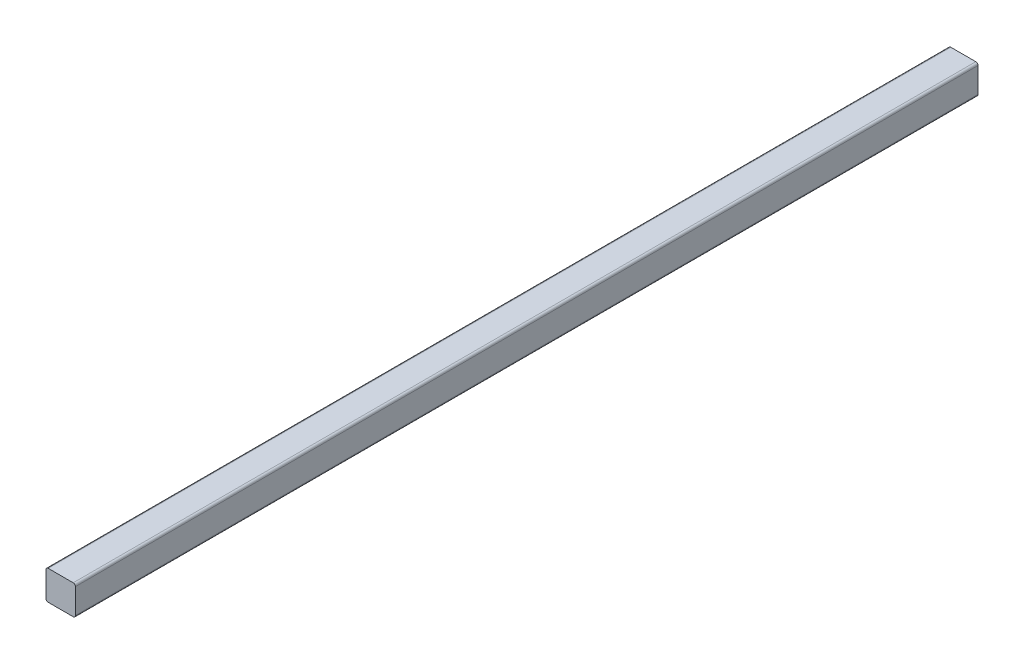
ISO-10303-21;
HEADER;
FILE_DESCRIPTION(('STEP AP214'),'2;1');
FILE_NAME('part.step','',(''),(''),'','','');
FILE_SCHEMA(('AUTOMOTIVE_DESIGN { 1 0 10303 214 1 1 1 1 }'));
ENDSEC;
DATA;
#1=APPLICATION_CONTEXT('core data for automotive mechanical design processes');
#2=APPLICATION_PROTOCOL_DEFINITION('international standard','automotive_design',2000,#1);
#3=PRODUCT_CONTEXT('',#1,'mechanical');
#4=PRODUCT('Part','Part','',(#3));
#5=PRODUCT_RELATED_PRODUCT_CATEGORY('part','',(#4));
#6=PRODUCT_DEFINITION_FORMATION('','',#4);
#7=PRODUCT_DEFINITION_CONTEXT('part definition',#1,'design');
#8=PRODUCT_DEFINITION('design','',#6,#7);
#9=PRODUCT_DEFINITION_SHAPE('','',#8);
#10=(LENGTH_UNIT() NAMED_UNIT(*) SI_UNIT(.MILLI.,.METRE.));
#11=(NAMED_UNIT(*) PLANE_ANGLE_UNIT() SI_UNIT($,.RADIAN.));
#12=(NAMED_UNIT(*) SI_UNIT($,.STERADIAN.) SOLID_ANGLE_UNIT());
#13=UNCERTAINTY_MEASURE_WITH_UNIT(LENGTH_MEASURE(1.E-05),#10,'distance_accuracy_value','');
#14=(GEOMETRIC_REPRESENTATION_CONTEXT(3) GLOBAL_UNCERTAINTY_ASSIGNED_CONTEXT((#13)) GLOBAL_UNIT_ASSIGNED_CONTEXT((#10,
#11,#12)) REPRESENTATION_CONTEXT('',''));
#15=CARTESIAN_POINT('',(0.,0.,0.));
#16=DIRECTION('',(0.,0.,1.));
#17=DIRECTION('',(1.,0.,0.));
#18=AXIS2_PLACEMENT_3D('',#15,#16,#17);
#19=CARTESIAN_POINT('',(12.75,12.75,920.));
#20=DIRECTION('',(0.,0.,-1.));
#21=DIRECTION('',(-1.,0.,0.));
#22=AXIS2_PLACEMENT_3D('',#19,#20,#21);
#23=CYLINDRICAL_SURFACE('',#22,2.25);
#24=CARTESIAN_POINT('',(12.75,12.75,0.));
#25=DIRECTION('',(0.,0.,1.));
#26=DIRECTION('',(-1.,0.,0.));
#27=AXIS2_PLACEMENT_3D('',#24,#25,#26);
#28=CIRCLE('',#27,2.25);
#29=CARTESIAN_POINT('',(15.,12.75,0.));
#30=VERTEX_POINT('',#29);
#31=CARTESIAN_POINT('',(12.75,15.,0.));
#32=VERTEX_POINT('',#31);
#33=EDGE_CURVE('E101',#30,#32,#28,.T.);
#34=ORIENTED_EDGE('',*,*,#33,.T.);
#35=DIRECTION('',(0.,0.,-1.));
#36=VECTOR('',#35,1.);
#37=CARTESIAN_POINT('',(12.75,15.,920.));
#38=LINE('',#37,#36);
#39=CARTESIAN_POINT('',(12.75,15.,920.));
#40=VERTEX_POINT('',#39);
#41=EDGE_CURVE('E11',#40,#32,#38,.T.);
#42=ORIENTED_EDGE('',*,*,#41,.F.);
#43=CARTESIAN_POINT('',(12.75,12.75,920.));
#44=DIRECTION('',(0.,0.,1.));
#45=DIRECTION('',(-1.,0.,0.));
#46=AXIS2_PLACEMENT_3D('',#43,#44,#45);
#47=CIRCLE('',#46,2.25);
#48=CARTESIAN_POINT('',(15.,12.75,920.));
#49=VERTEX_POINT('',#48);
#50=EDGE_CURVE('E128',#49,#40,#47,.T.);
#51=ORIENTED_EDGE('',*,*,#50,.F.);
#52=DIRECTION('',(0.,0.,-1.));
#53=VECTOR('',#52,1.);
#54=CARTESIAN_POINT('',(15.,12.75,920.));
#55=LINE('',#54,#53);
#56=EDGE_CURVE('E114',#49,#30,#55,.T.);
#57=ORIENTED_EDGE('',*,*,#56,.T.);
#58=EDGE_LOOP('',(#34,#42,#51,#57));
#59=FACE_BOUND('',#58,.T.);
#60=ADVANCED_FACE('F33',(#59),#23,.T.);
#61=CARTESIAN_POINT('',(-12.75,15.,920.));
#62=DIRECTION('',(0.,-1.,0.));
#63=DIRECTION('',(0.,0.,-1.));
#64=AXIS2_PLACEMENT_3D('',#61,#62,#63);
#65=PLANE('',#64);
#66=DIRECTION('',(-1.,0.,0.));
#67=VECTOR('',#66,1.);
#68=CARTESIAN_POINT('',(-12.75,15.,0.));
#69=LINE('',#68,#67);
#70=CARTESIAN_POINT('',(-12.75,15.,0.));
#71=VERTEX_POINT('',#70);
#72=EDGE_CURVE('E97',#32,#71,#69,.T.);
#73=ORIENTED_EDGE('',*,*,#72,.T.);
#74=DIRECTION('',(0.,0.,-1.));
#75=VECTOR('',#74,1.);
#76=CARTESIAN_POINT('',(-12.75,15.,920.));
#77=LINE('',#76,#75);
#78=CARTESIAN_POINT('',(-12.75,15.,920.));
#79=VERTEX_POINT('',#78);
#80=EDGE_CURVE('E40',#79,#71,#77,.T.);
#81=ORIENTED_EDGE('',*,*,#80,.F.);
#82=DIRECTION('',(-1.,0.,0.));
#83=VECTOR('',#82,1.);
#84=CARTESIAN_POINT('',(-12.75,15.,920.));
#85=LINE('',#84,#83);
#86=EDGE_CURVE('E110',#40,#79,#85,.T.);
#87=ORIENTED_EDGE('',*,*,#86,.F.);
#88=ORIENTED_EDGE('',*,*,#41,.T.);
#89=EDGE_LOOP('',(#73,#81,#87,#88));
#90=FACE_BOUND('',#89,.T.);
#91=ADVANCED_FACE('F109',(#90),#65,.F.);
#92=CARTESIAN_POINT('',(-12.75,12.75,920.));
#93=DIRECTION('',(0.,0.,-1.));
#94=DIRECTION('',(-1.,0.,0.));
#95=AXIS2_PLACEMENT_3D('',#92,#93,#94);
#96=CYLINDRICAL_SURFACE('',#95,2.25);
#97=CARTESIAN_POINT('',(-12.75,12.75,0.));
#98=DIRECTION('',(0.,0.,1.));
#99=DIRECTION('',(1.,0.,0.));
#100=AXIS2_PLACEMENT_3D('',#97,#98,#99);
#101=CIRCLE('',#100,2.25);
#102=CARTESIAN_POINT('',(-15.,12.75,0.));
#103=VERTEX_POINT('',#102);
#104=EDGE_CURVE('E103',#71,#103,#101,.T.);
#105=ORIENTED_EDGE('',*,*,#104,.T.);
#106=DIRECTION('',(0.,0.,-1.));
#107=VECTOR('',#106,1.);
#108=CARTESIAN_POINT('',(-15.,12.75,920.));
#109=LINE('',#108,#107);
#110=CARTESIAN_POINT('',(-15.,12.75,920.));
#111=VERTEX_POINT('',#110);
#112=EDGE_CURVE('E154',#111,#103,#109,.T.);
#113=ORIENTED_EDGE('',*,*,#112,.F.);
#114=CARTESIAN_POINT('',(-12.75,12.75,920.));
#115=DIRECTION('',(0.,0.,1.));
#116=DIRECTION('',(1.,0.,0.));
#117=AXIS2_PLACEMENT_3D('',#114,#115,#116);
#118=CIRCLE('',#117,2.25);
#119=EDGE_CURVE('E131',#79,#111,#118,.T.);
#120=ORIENTED_EDGE('',*,*,#119,.F.);
#121=ORIENTED_EDGE('',*,*,#80,.T.);
#122=EDGE_LOOP('',(#105,#113,#120,#121));
#123=FACE_BOUND('',#122,.T.);
#124=ADVANCED_FACE('F158',(#123),#96,.T.);
#125=CARTESIAN_POINT('',(-15.,12.75,920.));
#126=DIRECTION('',(1.,0.,0.));
#127=DIRECTION('',(0.,0.,-1.));
#128=AXIS2_PLACEMENT_3D('',#125,#126,#127);
#129=PLANE('',#128);
#130=DIRECTION('',(0.,-1.,0.));
#131=VECTOR('',#130,1.);
#132=CARTESIAN_POINT('',(-15.,12.75,0.));
#133=LINE('',#132,#131);
#134=CARTESIAN_POINT('',(-15.,-12.75,0.));
#135=VERTEX_POINT('',#134);
#136=EDGE_CURVE('E118',#103,#135,#133,.T.);
#137=ORIENTED_EDGE('',*,*,#136,.T.);
#138=DIRECTION('',(0.,0.,-1.));
#139=VECTOR('',#138,1.);
#140=CARTESIAN_POINT('',(-15.,-12.75,920.));
#141=LINE('',#140,#139);
#142=CARTESIAN_POINT('',(-15.,-12.75,920.));
#143=VERTEX_POINT('',#142);
#144=EDGE_CURVE('E151',#143,#135,#141,.T.);
#145=ORIENTED_EDGE('',*,*,#144,.F.);
#146=DIRECTION('',(0.,-1.,0.));
#147=VECTOR('',#146,1.);
#148=CARTESIAN_POINT('',(-15.,12.75,920.));
#149=LINE('',#148,#147);
#150=EDGE_CURVE('E133',#111,#143,#149,.T.);
#151=ORIENTED_EDGE('',*,*,#150,.F.);
#152=ORIENTED_EDGE('',*,*,#112,.T.);
#153=EDGE_LOOP('',(#137,#145,#151,#152));
#154=FACE_BOUND('',#153,.T.);
#155=ADVANCED_FACE('F166',(#154),#129,.F.);
#156=CARTESIAN_POINT('',(-12.75,-12.75,920.));
#157=DIRECTION('',(0.,0.,-1.));
#158=DIRECTION('',(-1.,0.,0.));
#159=AXIS2_PLACEMENT_3D('',#156,#157,#158);
#160=CYLINDRICAL_SURFACE('',#159,2.25);
#161=CARTESIAN_POINT('',(-12.75,-12.75,0.));
#162=DIRECTION('',(0.,0.,1.));
#163=DIRECTION('',(-1.,0.,0.));
#164=AXIS2_PLACEMENT_3D('',#161,#162,#163);
#165=CIRCLE('',#164,2.25);
#166=CARTESIAN_POINT('',(-12.75,-15.,0.));
#167=VERTEX_POINT('',#166);
#168=EDGE_CURVE('E120',#135,#167,#165,.T.);
#169=ORIENTED_EDGE('',*,*,#168,.T.);
#170=DIRECTION('',(0.,0.,-1.));
#171=VECTOR('',#170,1.);
#172=CARTESIAN_POINT('',(-12.75,-15.,920.));
#173=LINE('',#172,#171);
#174=CARTESIAN_POINT('',(-12.75,-15.,920.));
#175=VERTEX_POINT('',#174);
#176=EDGE_CURVE('E148',#175,#167,#173,.T.);
#177=ORIENTED_EDGE('',*,*,#176,.F.);
#178=CARTESIAN_POINT('',(-12.75,-12.75,920.));
#179=DIRECTION('',(0.,0.,1.));
#180=DIRECTION('',(-1.,0.,0.));
#181=AXIS2_PLACEMENT_3D('',#178,#179,#180);
#182=CIRCLE('',#181,2.25);
#183=EDGE_CURVE('E135',#143,#175,#182,.T.);
#184=ORIENTED_EDGE('',*,*,#183,.F.);
#185=ORIENTED_EDGE('',*,*,#144,.T.);
#186=EDGE_LOOP('',(#169,#177,#184,#185));
#187=FACE_BOUND('',#186,.T.);
#188=ADVANCED_FACE('F169',(#187),#160,.T.);
#189=CARTESIAN_POINT('',(-12.75,-15.,920.));
#190=DIRECTION('',(0.,1.,0.));
#191=DIRECTION('',(0.,0.,1.));
#192=AXIS2_PLACEMENT_3D('',#189,#190,#191);
#193=PLANE('',#192);
#194=DIRECTION('',(1.,0.,0.));
#195=VECTOR('',#194,1.);
#196=CARTESIAN_POINT('',(-12.75,-15.,0.));
#197=LINE('',#196,#195);
#198=CARTESIAN_POINT('',(12.75,-15.,0.));
#199=VERTEX_POINT('',#198);
#200=EDGE_CURVE('E122',#167,#199,#197,.T.);
#201=ORIENTED_EDGE('',*,*,#200,.T.);
#202=DIRECTION('',(0.,0.,-1.));
#203=VECTOR('',#202,1.);
#204=CARTESIAN_POINT('',(12.75,-15.,920.));
#205=LINE('',#204,#203);
#206=CARTESIAN_POINT('',(12.75,-15.,920.));
#207=VERTEX_POINT('',#206);
#208=EDGE_CURVE('E145',#207,#199,#205,.T.);
#209=ORIENTED_EDGE('',*,*,#208,.F.);
#210=DIRECTION('',(1.,0.,0.));
#211=VECTOR('',#210,1.);
#212=CARTESIAN_POINT('',(-12.75,-15.,920.));
#213=LINE('',#212,#211);
#214=EDGE_CURVE('E137',#175,#207,#213,.T.);
#215=ORIENTED_EDGE('',*,*,#214,.F.);
#216=ORIENTED_EDGE('',*,*,#176,.T.);
#217=EDGE_LOOP('',(#201,#209,#215,#216));
#218=FACE_BOUND('',#217,.T.);
#219=ADVANCED_FACE('F174',(#218),#193,.F.);
#220=CARTESIAN_POINT('',(12.75,-12.75,920.));
#221=DIRECTION('',(0.,0.,-1.));
#222=DIRECTION('',(-1.,0.,0.));
#223=AXIS2_PLACEMENT_3D('',#220,#221,#222);
#224=CYLINDRICAL_SURFACE('',#223,2.25);
#225=CARTESIAN_POINT('',(12.75,-12.75,0.));
#226=DIRECTION('',(0.,0.,1.));
#227=DIRECTION('',(1.,0.,0.));
#228=AXIS2_PLACEMENT_3D('',#225,#226,#227);
#229=CIRCLE('',#228,2.25);
#230=CARTESIAN_POINT('',(15.,-12.75,0.));
#231=VERTEX_POINT('',#230);
#232=EDGE_CURVE('E124',#199,#231,#229,.T.);
#233=ORIENTED_EDGE('',*,*,#232,.T.);
#234=DIRECTION('',(0.,0.,-1.));
#235=VECTOR('',#234,1.);
#236=CARTESIAN_POINT('',(15.,-12.75,920.));
#237=LINE('',#236,#235);
#238=CARTESIAN_POINT('',(15.,-12.75,920.));
#239=VERTEX_POINT('',#238);
#240=EDGE_CURVE('E142',#239,#231,#237,.T.);
#241=ORIENTED_EDGE('',*,*,#240,.F.);
#242=CARTESIAN_POINT('',(12.75,-12.75,920.));
#243=DIRECTION('',(0.,0.,1.));
#244=DIRECTION('',(1.,0.,0.));
#245=AXIS2_PLACEMENT_3D('',#242,#243,#244);
#246=CIRCLE('',#245,2.25);
#247=EDGE_CURVE('E52',#207,#239,#246,.T.);
#248=ORIENTED_EDGE('',*,*,#247,.F.);
#249=ORIENTED_EDGE('',*,*,#208,.T.);
#250=EDGE_LOOP('',(#233,#241,#248,#249));
#251=FACE_BOUND('',#250,.T.);
#252=ADVANCED_FACE('F177',(#251),#224,.T.);
#253=CARTESIAN_POINT('',(15.,12.75,920.));
#254=DIRECTION('',(-1.,0.,0.));
#255=DIRECTION('',(0.,0.,1.));
#256=AXIS2_PLACEMENT_3D('',#253,#254,#255);
#257=PLANE('',#256);
#258=DIRECTION('',(0.,1.,0.));
#259=VECTOR('',#258,1.);
#260=CARTESIAN_POINT('',(15.,12.75,0.));
#261=LINE('',#260,#259);
#262=EDGE_CURVE('E126',#231,#30,#261,.T.);
#263=ORIENTED_EDGE('',*,*,#262,.T.);
#264=ORIENTED_EDGE('',*,*,#56,.F.);
#265=DIRECTION('',(0.,1.,0.));
#266=VECTOR('',#265,1.);
#267=CARTESIAN_POINT('',(15.,12.75,920.));
#268=LINE('',#267,#266);
#269=EDGE_CURVE('E47',#239,#49,#268,.T.);
#270=ORIENTED_EDGE('',*,*,#269,.F.);
#271=ORIENTED_EDGE('',*,*,#240,.T.);
#272=EDGE_LOOP('',(#263,#264,#270,#271));
#273=FACE_BOUND('',#272,.T.);
#274=ADVANCED_FACE('F179',(#273),#257,.F.);
#275=CARTESIAN_POINT('',(12.75,12.75,920.));
#276=DIRECTION('',(0.,0.,-1.));
#277=DIRECTION('',(-1.,0.,0.));
#278=AXIS2_PLACEMENT_3D('',#275,#276,#277);
#279=PLANE('',#278);
#280=ORIENTED_EDGE('',*,*,#50,.T.);
#281=ORIENTED_EDGE('',*,*,#86,.T.);
#282=ORIENTED_EDGE('',*,*,#119,.T.);
#283=ORIENTED_EDGE('',*,*,#150,.T.);
#284=ORIENTED_EDGE('',*,*,#183,.T.);
#285=ORIENTED_EDGE('',*,*,#214,.T.);
#286=ORIENTED_EDGE('',*,*,#247,.T.);
#287=ORIENTED_EDGE('',*,*,#269,.T.);
#288=EDGE_LOOP('',(#280,#281,#282,#283,#284,#285,#286,#287));
#289=FACE_BOUND('',#288,.T.);
#290=ADVANCED_FACE('F161',(#289),#279,.F.);
#291=CARTESIAN_POINT('',(12.75,12.75,0.));
#292=DIRECTION('',(0.,0.,-1.));
#293=DIRECTION('',(-1.,0.,0.));
#294=AXIS2_PLACEMENT_3D('',#291,#292,#293);
#295=PLANE('',#294);
#296=ORIENTED_EDGE('',*,*,#33,.F.);
#297=ORIENTED_EDGE('',*,*,#262,.F.);
#298=ORIENTED_EDGE('',*,*,#232,.F.);
#299=ORIENTED_EDGE('',*,*,#200,.F.);
#300=ORIENTED_EDGE('',*,*,#168,.F.);
#301=ORIENTED_EDGE('',*,*,#136,.F.);
#302=ORIENTED_EDGE('',*,*,#104,.F.);
#303=ORIENTED_EDGE('',*,*,#72,.F.);
#304=EDGE_LOOP('',(#296,#297,#298,#299,#300,#301,#302,#303));
#305=FACE_BOUND('',#304,.T.);
#306=ADVANCED_FACE('F98',(#305),#295,.T.);
#307=CLOSED_SHELL('',(#60,#91,#124,#155,#188,#219,#252,#274,#290,#306));
#308=MANIFOLD_SOLID_BREP('B2',#307);
#309=ADVANCED_BREP_SHAPE_REPRESENTATION('',(#18,#308),#14);
#310=SHAPE_DEFINITION_REPRESENTATION(#9,#309);
ENDSEC;
END-ISO-10303-21;
